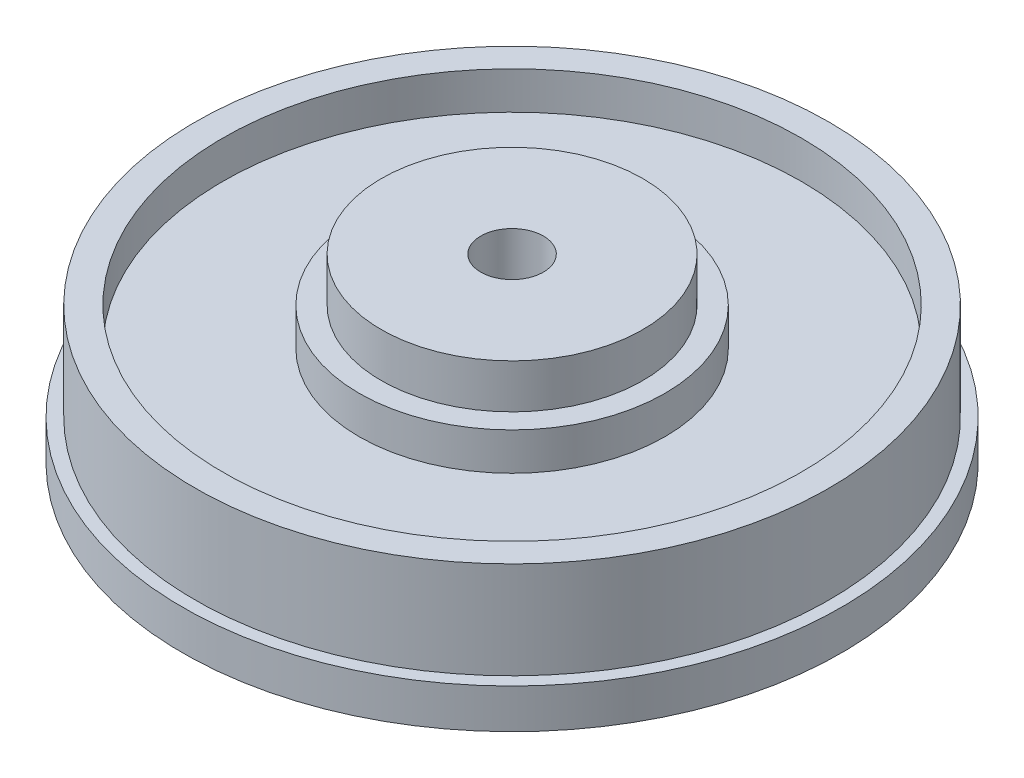
ISO-10303-21;
HEADER;
FILE_DESCRIPTION(('STEP AP214'),'2;1');
FILE_NAME('part.step','',(''),(''),'','','');
FILE_SCHEMA(('AUTOMOTIVE_DESIGN { 1 0 10303 214 1 1 1 1 }'));
ENDSEC;
DATA;
#1=APPLICATION_CONTEXT('core data for automotive mechanical design processes');
#2=APPLICATION_PROTOCOL_DEFINITION('international standard','automotive_design',2000,#1);
#3=PRODUCT_CONTEXT('',#1,'mechanical');
#4=PRODUCT('Part','Part','',(#3));
#5=PRODUCT_RELATED_PRODUCT_CATEGORY('part','',(#4));
#6=PRODUCT_DEFINITION_FORMATION('','',#4);
#7=PRODUCT_DEFINITION_CONTEXT('part definition',#1,'design');
#8=PRODUCT_DEFINITION('design','',#6,#7);
#9=PRODUCT_DEFINITION_SHAPE('','',#8);
#10=(LENGTH_UNIT() NAMED_UNIT(*) SI_UNIT(.MILLI.,.METRE.));
#11=(NAMED_UNIT(*) PLANE_ANGLE_UNIT() SI_UNIT($,.RADIAN.));
#12=(NAMED_UNIT(*) SI_UNIT($,.STERADIAN.) SOLID_ANGLE_UNIT());
#13=UNCERTAINTY_MEASURE_WITH_UNIT(LENGTH_MEASURE(1.E-05),#10,'distance_accuracy_value','');
#14=(GEOMETRIC_REPRESENTATION_CONTEXT(3) GLOBAL_UNCERTAINTY_ASSIGNED_CONTEXT((#13)) GLOBAL_UNIT_ASSIGNED_CONTEXT((#10,
#11,#12)) REPRESENTATION_CONTEXT('',''));
#15=CARTESIAN_POINT('',(0.,0.,0.));
#16=DIRECTION('',(0.,0.,1.));
#17=DIRECTION('',(1.,0.,0.));
#18=AXIS2_PLACEMENT_3D('',#15,#16,#17);
#19=CARTESIAN_POINT('',(19.85,0.,0.));
#20=DIRECTION('',(0.,-1.,0.));
#21=DIRECTION('',(0.,0.,-1.));
#22=AXIS2_PLACEMENT_3D('',#19,#20,#21);
#23=PLANE('',#22);
#24=CARTESIAN_POINT('',(0.,0.,0.));
#25=DIRECTION('',(0.,-1.,0.));
#26=DIRECTION('',(0.,0.,-1.));
#27=AXIS2_PLACEMENT_3D('',#24,#25,#26);
#28=CIRCLE('',#27,19.85);
#29=CARTESIAN_POINT('',(0.,0.,-19.85));
#30=VERTEX_POINT('',#29);
#31=EDGE_CURVE('E83',#30,#30,#28,.T.);
#32=ORIENTED_EDGE('',*,*,#31,.T.);
#33=EDGE_LOOP('',(#32));
#34=FACE_BOUND('',#33,.T.);
#35=CARTESIAN_POINT('',(0.,0.,0.));
#36=DIRECTION('',(0.,-1.,0.));
#37=DIRECTION('',(0.,0.,-1.));
#38=AXIS2_PLACEMENT_3D('',#35,#36,#37);
#39=CIRCLE('',#38,4.75);
#40=CARTESIAN_POINT('',(0.,0.,-4.75));
#41=VERTEX_POINT('',#40);
#42=EDGE_CURVE('E10',#41,#41,#39,.T.);
#43=ORIENTED_EDGE('',*,*,#42,.F.);
#44=EDGE_LOOP('',(#43));
#45=FACE_BOUND('',#44,.T.);
#46=ADVANCED_FACE('F31',(#34,#45),#23,.T.);
#47=CARTESIAN_POINT('',(0.,0.,0.));
#48=DIRECTION('',(0.,-1.,0.));
#49=DIRECTION('',(0.,0.,-1.));
#50=AXIS2_PLACEMENT_3D('',#47,#48,#49);
#51=CYLINDRICAL_SURFACE('',#50,4.75);
#52=ORIENTED_EDGE('',*,*,#42,.T.);
#53=EDGE_LOOP('',(#52));
#54=FACE_BOUND('',#53,.T.);
#55=CARTESIAN_POINT('',(0.,27.4,0.));
#56=DIRECTION('',(0.,-1.,0.));
#57=DIRECTION('',(0.,0.,-1.));
#58=AXIS2_PLACEMENT_3D('',#55,#56,#57);
#59=CIRCLE('',#58,4.75);
#60=CARTESIAN_POINT('',(0.,27.4,-4.75));
#61=VERTEX_POINT('',#60);
#62=EDGE_CURVE('E37',#61,#61,#59,.T.);
#63=ORIENTED_EDGE('',*,*,#62,.F.);
#64=EDGE_LOOP('',(#63));
#65=FACE_BOUND('',#64,.T.);
#66=ADVANCED_FACE('F101',(#54,#65),#51,.F.);
#67=CARTESIAN_POINT('',(4.75,27.4,0.));
#68=DIRECTION('',(0.,1.,0.));
#69=DIRECTION('',(0.,0.,1.));
#70=AXIS2_PLACEMENT_3D('',#67,#68,#69);
#71=PLANE('',#70);
#72=ORIENTED_EDGE('',*,*,#62,.T.);
#73=EDGE_LOOP('',(#72));
#74=FACE_BOUND('',#73,.T.);
#75=CARTESIAN_POINT('',(0.,27.4,0.));
#76=DIRECTION('',(0.,-1.,0.));
#77=DIRECTION('',(0.,0.,-1.));
#78=AXIS2_PLACEMENT_3D('',#75,#76,#77);
#79=CIRCLE('',#78,19.85);
#80=CARTESIAN_POINT('',(0.,27.4,-19.85));
#81=VERTEX_POINT('',#80);
#82=EDGE_CURVE('E41',#81,#81,#79,.T.);
#83=ORIENTED_EDGE('',*,*,#82,.F.);
#84=EDGE_LOOP('',(#83));
#85=FACE_BOUND('',#84,.T.);
#86=ADVANCED_FACE('F105',(#74,#85),#71,.T.);
#87=CARTESIAN_POINT('',(0.,0.,0.));
#88=DIRECTION('',(0.,-1.,0.));
#89=DIRECTION('',(0.,0.,-1.));
#90=AXIS2_PLACEMENT_3D('',#87,#88,#89);
#91=CYLINDRICAL_SURFACE('',#90,19.85);
#92=ORIENTED_EDGE('',*,*,#82,.T.);
#93=EDGE_LOOP('',(#92));
#94=FACE_BOUND('',#93,.T.);
#95=CARTESIAN_POINT('',(0.,20.7,0.));
#96=DIRECTION('',(0.,-1.,0.));
#97=DIRECTION('',(0.,0.,-1.));
#98=AXIS2_PLACEMENT_3D('',#95,#96,#97);
#99=CIRCLE('',#98,19.85);
#100=CARTESIAN_POINT('',(0.,20.7,-19.85));
#101=VERTEX_POINT('',#100);
#102=EDGE_CURVE('E45',#101,#101,#99,.T.);
#103=ORIENTED_EDGE('',*,*,#102,.F.);
#104=EDGE_LOOP('',(#103));
#105=FACE_BOUND('',#104,.T.);
#106=ADVANCED_FACE('F109',(#94,#105),#91,.T.);
#107=CARTESIAN_POINT('',(19.85,20.7,0.));
#108=DIRECTION('',(0.,1.,0.));
#109=DIRECTION('',(0.,0.,1.));
#110=AXIS2_PLACEMENT_3D('',#107,#108,#109);
#111=PLANE('',#110);
#112=ORIENTED_EDGE('',*,*,#102,.T.);
#113=EDGE_LOOP('',(#112));
#114=FACE_BOUND('',#113,.T.);
#115=CARTESIAN_POINT('',(0.,20.7,0.));
#116=DIRECTION('',(0.,-1.,0.));
#117=DIRECTION('',(0.,0.,-1.));
#118=AXIS2_PLACEMENT_3D('',#115,#116,#117);
#119=CIRCLE('',#118,23.2);
#120=CARTESIAN_POINT('',(0.,20.7,-23.2));
#121=VERTEX_POINT('',#120);
#122=EDGE_CURVE('E50',#121,#121,#119,.T.);
#123=ORIENTED_EDGE('',*,*,#122,.F.);
#124=EDGE_LOOP('',(#123));
#125=FACE_BOUND('',#124,.T.);
#126=ADVANCED_FACE('F115',(#114,#125),#111,.T.);
#127=CARTESIAN_POINT('',(0.,0.,0.));
#128=DIRECTION('',(0.,-1.,0.));
#129=DIRECTION('',(0.,0.,-1.));
#130=AXIS2_PLACEMENT_3D('',#127,#128,#129);
#131=CYLINDRICAL_SURFACE('',#130,23.2);
#132=ORIENTED_EDGE('',*,*,#122,.T.);
#133=EDGE_LOOP('',(#132));
#134=FACE_BOUND('',#133,.T.);
#135=CARTESIAN_POINT('',(0.,15.,0.));
#136=DIRECTION('',(0.,-1.,0.));
#137=DIRECTION('',(0.,0.,-1.));
#138=AXIS2_PLACEMENT_3D('',#135,#136,#137);
#139=CIRCLE('',#138,23.2);
#140=CARTESIAN_POINT('',(0.,15.,-23.2));
#141=VERTEX_POINT('',#140);
#142=EDGE_CURVE('E53',#141,#141,#139,.T.);
#143=ORIENTED_EDGE('',*,*,#142,.F.);
#144=EDGE_LOOP('',(#143));
#145=FACE_BOUND('',#144,.T.);
#146=ADVANCED_FACE('F119',(#134,#145),#131,.T.);
#147=CARTESIAN_POINT('',(23.2,15.,0.));
#148=DIRECTION('',(0.,1.,0.));
#149=DIRECTION('',(0.,0.,1.));
#150=AXIS2_PLACEMENT_3D('',#147,#148,#149);
#151=PLANE('',#150);
#152=ORIENTED_EDGE('',*,*,#142,.T.);
#153=EDGE_LOOP('',(#152));
#154=FACE_BOUND('',#153,.T.);
#155=CARTESIAN_POINT('',(0.,15.,0.));
#156=DIRECTION('',(0.,-1.,0.));
#157=DIRECTION('',(0.,0.,-1.));
#158=AXIS2_PLACEMENT_3D('',#155,#156,#157);
#159=CIRCLE('',#158,43.9);
#160=CARTESIAN_POINT('',(0.,15.,-43.9));
#161=VERTEX_POINT('',#160);
#162=EDGE_CURVE('E56',#161,#161,#159,.T.);
#163=ORIENTED_EDGE('',*,*,#162,.F.);
#164=EDGE_LOOP('',(#163));
#165=FACE_BOUND('',#164,.T.);
#166=ADVANCED_FACE('F123',(#154,#165),#151,.T.);
#167=CARTESIAN_POINT('',(0.,0.,0.));
#168=DIRECTION('',(0.,-1.,0.));
#169=DIRECTION('',(0.,0.,-1.));
#170=AXIS2_PLACEMENT_3D('',#167,#168,#169);
#171=CYLINDRICAL_SURFACE('',#170,43.9);
#172=ORIENTED_EDGE('',*,*,#162,.T.);
#173=EDGE_LOOP('',(#172));
#174=FACE_BOUND('',#173,.T.);
#175=CARTESIAN_POINT('',(0.,20.7,0.));
#176=DIRECTION('',(0.,-1.,0.));
#177=DIRECTION('',(0.,0.,-1.));
#178=AXIS2_PLACEMENT_3D('',#175,#176,#177);
#179=CIRCLE('',#178,43.9);
#180=CARTESIAN_POINT('',(0.,20.7,-43.9));
#181=VERTEX_POINT('',#180);
#182=EDGE_CURVE('E59',#181,#181,#179,.T.);
#183=ORIENTED_EDGE('',*,*,#182,.F.);
#184=EDGE_LOOP('',(#183));
#185=FACE_BOUND('',#184,.T.);
#186=ADVANCED_FACE('F127',(#174,#185),#171,.F.);
#187=CARTESIAN_POINT('',(43.9,20.7,0.));
#188=DIRECTION('',(0.,1.,0.));
#189=DIRECTION('',(0.,0.,1.));
#190=AXIS2_PLACEMENT_3D('',#187,#188,#189);
#191=PLANE('',#190);
#192=ORIENTED_EDGE('',*,*,#182,.T.);
#193=EDGE_LOOP('',(#192));
#194=FACE_BOUND('',#193,.T.);
#195=CARTESIAN_POINT('',(0.,20.7,0.));
#196=DIRECTION('',(0.,-1.,0.));
#197=DIRECTION('',(0.,0.,-1.));
#198=AXIS2_PLACEMENT_3D('',#195,#196,#197);
#199=CIRCLE('',#198,48.1);
#200=CARTESIAN_POINT('',(0.,20.7,-48.1));
#201=VERTEX_POINT('',#200);
#202=EDGE_CURVE('E62',#201,#201,#199,.T.);
#203=ORIENTED_EDGE('',*,*,#202,.F.);
#204=EDGE_LOOP('',(#203));
#205=FACE_BOUND('',#204,.T.);
#206=ADVANCED_FACE('F131',(#194,#205),#191,.T.);
#207=CARTESIAN_POINT('',(0.,0.,0.));
#208=DIRECTION('',(0.,-1.,0.));
#209=DIRECTION('',(0.,0.,-1.));
#210=AXIS2_PLACEMENT_3D('',#207,#208,#209);
#211=CYLINDRICAL_SURFACE('',#210,48.1);
#212=ORIENTED_EDGE('',*,*,#202,.T.);
#213=EDGE_LOOP('',(#212));
#214=FACE_BOUND('',#213,.T.);
#215=CARTESIAN_POINT('',(0.,6.,0.));
#216=DIRECTION('',(0.,-1.,0.));
#217=DIRECTION('',(0.,0.,-1.));
#218=AXIS2_PLACEMENT_3D('',#215,#216,#217);
#219=CIRCLE('',#218,48.1);
#220=CARTESIAN_POINT('',(0.,6.,-48.1));
#221=VERTEX_POINT('',#220);
#222=EDGE_CURVE('E65',#221,#221,#219,.T.);
#223=ORIENTED_EDGE('',*,*,#222,.F.);
#224=EDGE_LOOP('',(#223));
#225=FACE_BOUND('',#224,.T.);
#226=ADVANCED_FACE('F135',(#214,#225),#211,.T.);
#227=CARTESIAN_POINT('',(48.1,6.,0.));
#228=DIRECTION('',(0.,1.,0.));
#229=DIRECTION('',(0.,0.,1.));
#230=AXIS2_PLACEMENT_3D('',#227,#228,#229);
#231=PLANE('',#230);
#232=ORIENTED_EDGE('',*,*,#222,.T.);
#233=EDGE_LOOP('',(#232));
#234=FACE_BOUND('',#233,.T.);
#235=CARTESIAN_POINT('',(0.,6.,0.));
#236=DIRECTION('',(0.,-1.,0.));
#237=DIRECTION('',(0.,0.,-1.));
#238=AXIS2_PLACEMENT_3D('',#235,#236,#237);
#239=CIRCLE('',#238,50.);
#240=CARTESIAN_POINT('',(0.,6.,-50.));
#241=VERTEX_POINT('',#240);
#242=EDGE_CURVE('E68',#241,#241,#239,.T.);
#243=ORIENTED_EDGE('',*,*,#242,.F.);
#244=EDGE_LOOP('',(#243));
#245=FACE_BOUND('',#244,.T.);
#246=ADVANCED_FACE('F139',(#234,#245),#231,.T.);
#247=CARTESIAN_POINT('',(0.,0.,0.));
#248=DIRECTION('',(0.,-1.,0.));
#249=DIRECTION('',(0.,0.,-1.));
#250=AXIS2_PLACEMENT_3D('',#247,#248,#249);
#251=CYLINDRICAL_SURFACE('',#250,50.);
#252=ORIENTED_EDGE('',*,*,#242,.T.);
#253=EDGE_LOOP('',(#252));
#254=FACE_BOUND('',#253,.T.);
#255=CARTESIAN_POINT('',(0.,0.,0.));
#256=DIRECTION('',(0.,-1.,0.));
#257=DIRECTION('',(0.,0.,-1.));
#258=AXIS2_PLACEMENT_3D('',#255,#256,#257);
#259=CIRCLE('',#258,50.);
#260=CARTESIAN_POINT('',(0.,0.,-50.));
#261=VERTEX_POINT('',#260);
#262=EDGE_CURVE('E71',#261,#261,#259,.T.);
#263=ORIENTED_EDGE('',*,*,#262,.F.);
#264=EDGE_LOOP('',(#263));
#265=FACE_BOUND('',#264,.T.);
#266=ADVANCED_FACE('F143',(#254,#265),#251,.T.);
#267=CARTESIAN_POINT('',(50.,0.,0.));
#268=DIRECTION('',(0.,-1.,0.));
#269=DIRECTION('',(0.,0.,-1.));
#270=AXIS2_PLACEMENT_3D('',#267,#268,#269);
#271=PLANE('',#270);
#272=ORIENTED_EDGE('',*,*,#262,.T.);
#273=EDGE_LOOP('',(#272));
#274=FACE_BOUND('',#273,.T.);
#275=CARTESIAN_POINT('',(0.,0.,0.));
#276=DIRECTION('',(0.,-1.,0.));
#277=DIRECTION('',(0.,0.,-1.));
#278=AXIS2_PLACEMENT_3D('',#275,#276,#277);
#279=CIRCLE('',#278,39.85);
#280=CARTESIAN_POINT('',(0.,0.,-39.85));
#281=VERTEX_POINT('',#280);
#282=EDGE_CURVE('E74',#281,#281,#279,.T.);
#283=ORIENTED_EDGE('',*,*,#282,.F.);
#284=EDGE_LOOP('',(#283));
#285=FACE_BOUND('',#284,.T.);
#286=ADVANCED_FACE('F147',(#274,#285),#271,.T.);
#287=CARTESIAN_POINT('',(0.,0.,0.));
#288=DIRECTION('',(0.,-1.,0.));
#289=DIRECTION('',(0.,0.,-1.));
#290=AXIS2_PLACEMENT_3D('',#287,#288,#289);
#291=CYLINDRICAL_SURFACE('',#290,39.85);
#292=ORIENTED_EDGE('',*,*,#282,.T.);
#293=EDGE_LOOP('',(#292));
#294=FACE_BOUND('',#293,.T.);
#295=CARTESIAN_POINT('',(0.,2.,0.));
#296=DIRECTION('',(0.,-1.,0.));
#297=DIRECTION('',(0.,0.,-1.));
#298=AXIS2_PLACEMENT_3D('',#295,#296,#297);
#299=CIRCLE('',#298,39.85);
#300=CARTESIAN_POINT('',(0.,2.,-39.85));
#301=VERTEX_POINT('',#300);
#302=EDGE_CURVE('E77',#301,#301,#299,.T.);
#303=ORIENTED_EDGE('',*,*,#302,.F.);
#304=EDGE_LOOP('',(#303));
#305=FACE_BOUND('',#304,.T.);
#306=ADVANCED_FACE('F97',(#294,#305),#291,.F.);
#307=CARTESIAN_POINT('',(19.85,2.,0.));
#308=DIRECTION('',(0.,-1.,0.));
#309=DIRECTION('',(0.,0.,-1.));
#310=AXIS2_PLACEMENT_3D('',#307,#308,#309);
#311=PLANE('',#310);
#312=ORIENTED_EDGE('',*,*,#302,.T.);
#313=EDGE_LOOP('',(#312));
#314=FACE_BOUND('',#313,.T.);
#315=CARTESIAN_POINT('',(0.,2.,0.));
#316=DIRECTION('',(0.,-1.,0.));
#317=DIRECTION('',(0.,0.,-1.));
#318=AXIS2_PLACEMENT_3D('',#315,#316,#317);
#319=CIRCLE('',#318,19.85);
#320=CARTESIAN_POINT('',(0.,2.,-19.85));
#321=VERTEX_POINT('',#320);
#322=EDGE_CURVE('E80',#321,#321,#319,.T.);
#323=ORIENTED_EDGE('',*,*,#322,.F.);
#324=EDGE_LOOP('',(#323));
#325=FACE_BOUND('',#324,.T.);
#326=ADVANCED_FACE('F91',(#314,#325),#311,.T.);
#327=CARTESIAN_POINT('',(0.,0.,0.));
#328=DIRECTION('',(0.,-1.,0.));
#329=DIRECTION('',(0.,0.,-1.));
#330=AXIS2_PLACEMENT_3D('',#327,#328,#329);
#331=CYLINDRICAL_SURFACE('',#330,19.85);
#332=ORIENTED_EDGE('',*,*,#322,.T.);
#333=EDGE_LOOP('',(#332));
#334=FACE_BOUND('',#333,.T.);
#335=ORIENTED_EDGE('',*,*,#31,.F.);
#336=EDGE_LOOP('',(#335));
#337=FACE_BOUND('',#336,.T.);
#338=ADVANCED_FACE('F89',(#334,#337),#331,.T.);
#339=CLOSED_SHELL('',(#46,#66,#86,#106,#126,#146,#166,#186,#206,#226,#246,#266,#286,#306,#326,#338));
#340=MANIFOLD_SOLID_BREP('B2',#339);
#341=ADVANCED_BREP_SHAPE_REPRESENTATION('',(#18,#340),#14);
#342=SHAPE_DEFINITION_REPRESENTATION(#9,#341);
ENDSEC;
END-ISO-10303-21;
